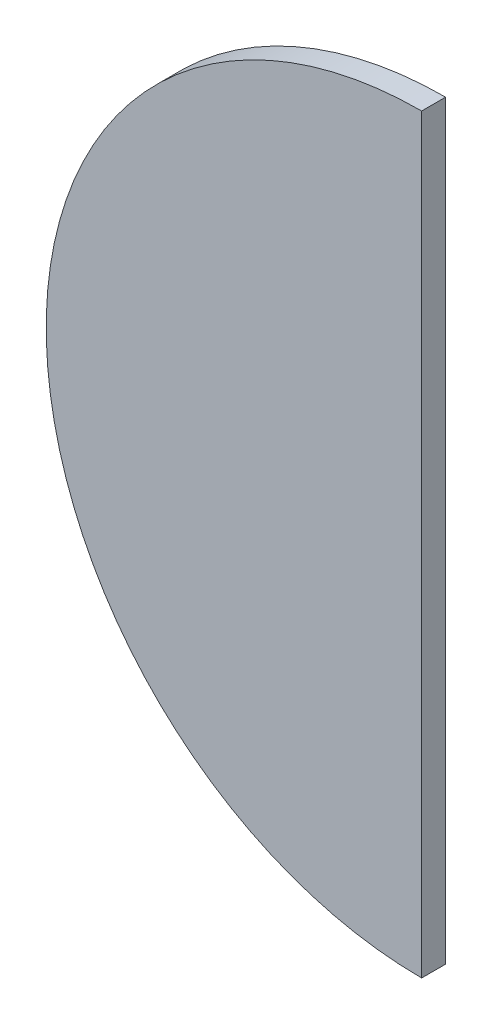
ISO-10303-21;
HEADER;
FILE_DESCRIPTION(('STEP AP214'),'2;1');
FILE_NAME('part.step','',(''),(''),'','','');
FILE_SCHEMA(('AUTOMOTIVE_DESIGN { 1 0 10303 214 1 1 1 1 }'));
ENDSEC;
DATA;
#1=APPLICATION_CONTEXT('core data for automotive mechanical design processes');
#2=APPLICATION_PROTOCOL_DEFINITION('international standard','automotive_design',2000,#1);
#3=PRODUCT_CONTEXT('',#1,'mechanical');
#4=PRODUCT('Part','Part','',(#3));
#5=PRODUCT_RELATED_PRODUCT_CATEGORY('part','',(#4));
#6=PRODUCT_DEFINITION_FORMATION('','',#4);
#7=PRODUCT_DEFINITION_CONTEXT('part definition',#1,'design');
#8=PRODUCT_DEFINITION('design','',#6,#7);
#9=PRODUCT_DEFINITION_SHAPE('','',#8);
#10=(LENGTH_UNIT() NAMED_UNIT(*) SI_UNIT(.MILLI.,.METRE.));
#11=(NAMED_UNIT(*) PLANE_ANGLE_UNIT() SI_UNIT($,.RADIAN.));
#12=(NAMED_UNIT(*) SI_UNIT($,.STERADIAN.) SOLID_ANGLE_UNIT());
#13=UNCERTAINTY_MEASURE_WITH_UNIT(LENGTH_MEASURE(1.E-05),#10,'distance_accuracy_value','');
#14=(GEOMETRIC_REPRESENTATION_CONTEXT(3) GLOBAL_UNCERTAINTY_ASSIGNED_CONTEXT((#13)) GLOBAL_UNIT_ASSIGNED_CONTEXT((#10,
#11,#12)) REPRESENTATION_CONTEXT('',''));
#15=CARTESIAN_POINT('',(0.,0.,0.));
#16=DIRECTION('',(0.,0.,1.));
#17=DIRECTION('',(1.,0.,0.));
#18=AXIS2_PLACEMENT_3D('',#15,#16,#17);
#19=CARTESIAN_POINT('',(-300.,0.,0.));
#20=DIRECTION('',(-1.,0.,0.));
#21=DIRECTION('',(0.,0.,1.));
#22=AXIS2_PLACEMENT_3D('',#19,#20,#21);
#23=PLANE('',#22);
#24=DIRECTION('',(0.,0.,-1.));
#25=VECTOR('',#24,1.);
#26=CARTESIAN_POINT('',(-300.,47.,60.01));
#27=LINE('',#26,#25);
#28=CARTESIAN_POINT('',(-300.,47.,3.));
#29=VERTEX_POINT('',#28);
#30=CARTESIAN_POINT('',(-300.,47.,0.));
#31=VERTEX_POINT('',#30);
#32=EDGE_CURVE('E60',#29,#31,#27,.T.);
#33=ORIENTED_EDGE('',*,*,#32,.F.);
#34=DIRECTION('',(0.,-1.,0.));
#35=VECTOR('',#34,1.);
#36=CARTESIAN_POINT('',(-300.,0.,3.));
#37=LINE('',#36,#35);
#38=CARTESIAN_POINT('',(-300.,-47.,3.));
#39=VERTEX_POINT('',#38);
#40=EDGE_CURVE('E40',#29,#39,#37,.T.);
#41=ORIENTED_EDGE('',*,*,#40,.T.);
#42=DIRECTION('',(0.,0.,-1.));
#43=VECTOR('',#42,1.);
#44=CARTESIAN_POINT('',(-300.,-47.,60.01));
#45=LINE('',#44,#43);
#46=CARTESIAN_POINT('',(-300.,-47.,0.));
#47=VERTEX_POINT('',#46);
#48=EDGE_CURVE('E11',#39,#47,#45,.T.);
#49=ORIENTED_EDGE('',*,*,#48,.T.);
#50=DIRECTION('',(0.,-1.,0.));
#51=VECTOR('',#50,1.);
#52=CARTESIAN_POINT('',(-300.,0.,0.));
#53=LINE('',#52,#51);
#54=EDGE_CURVE('E35',#31,#47,#53,.T.);
#55=ORIENTED_EDGE('',*,*,#54,.F.);
#56=EDGE_LOOP('',(#33,#41,#49,#55));
#57=FACE_BOUND('',#56,.T.);
#58=ADVANCED_FACE('F32',(#57),#23,.F.);
#59=CARTESIAN_POINT('',(-300.,0.,60.01));
#60=DIRECTION('',(0.,0.,-1.));
#61=DIRECTION('',(-1.,0.,0.));
#62=AXIS2_PLACEMENT_3D('',#59,#60,#61);
#63=CYLINDRICAL_SURFACE('',#62,47.);
#64=CARTESIAN_POINT('',(-300.,0.,3.));
#65=DIRECTION('',(0.,0.,1.));
#66=DIRECTION('',(1.,0.,0.));
#67=AXIS2_PLACEMENT_3D('',#64,#65,#66);
#68=CIRCLE('',#67,47.);
#69=EDGE_CURVE('E64',#29,#39,#68,.T.);
#70=ORIENTED_EDGE('',*,*,#69,.F.);
#71=ORIENTED_EDGE('',*,*,#32,.T.);
#72=CARTESIAN_POINT('',(-300.,0.,0.));
#73=DIRECTION('',(0.,0.,-1.));
#74=DIRECTION('',(-1.,0.,0.));
#75=AXIS2_PLACEMENT_3D('',#72,#73,#74);
#76=CIRCLE('',#75,47.);
#77=EDGE_CURVE('E62',#47,#31,#76,.T.);
#78=ORIENTED_EDGE('',*,*,#77,.F.);
#79=ORIENTED_EDGE('',*,*,#48,.F.);
#80=EDGE_LOOP('',(#70,#71,#78,#79));
#81=FACE_BOUND('',#80,.T.);
#82=ADVANCED_FACE('F61',(#81),#63,.T.);
#83=CARTESIAN_POINT('',(-300.,0.,3.));
#84=DIRECTION('',(0.,0.,1.));
#85=DIRECTION('',(1.,0.,0.));
#86=AXIS2_PLACEMENT_3D('',#83,#84,#85);
#87=PLANE('',#86);
#88=ORIENTED_EDGE('',*,*,#40,.F.);
#89=ORIENTED_EDGE('',*,*,#69,.T.);
#90=EDGE_LOOP('',(#88,#89));
#91=FACE_BOUND('',#90,.T.);
#92=ADVANCED_FACE('F70',(#91),#87,.T.);
#93=CARTESIAN_POINT('',(-300.,0.,0.));
#94=DIRECTION('',(0.,0.,1.));
#95=DIRECTION('',(1.,0.,0.));
#96=AXIS2_PLACEMENT_3D('',#93,#94,#95);
#97=PLANE('',#96);
#98=ORIENTED_EDGE('',*,*,#77,.T.);
#99=ORIENTED_EDGE('',*,*,#54,.T.);
#100=EDGE_LOOP('',(#98,#99));
#101=FACE_BOUND('',#100,.T.);
#102=ADVANCED_FACE('F66',(#101),#97,.F.);
#103=CLOSED_SHELL('',(#58,#82,#92,#102));
#104=MANIFOLD_SOLID_BREP('B2',#103);
#105=ADVANCED_BREP_SHAPE_REPRESENTATION('',(#18,#104),#14);
#106=SHAPE_DEFINITION_REPRESENTATION(#9,#105);
ENDSEC;
END-ISO-10303-21;
